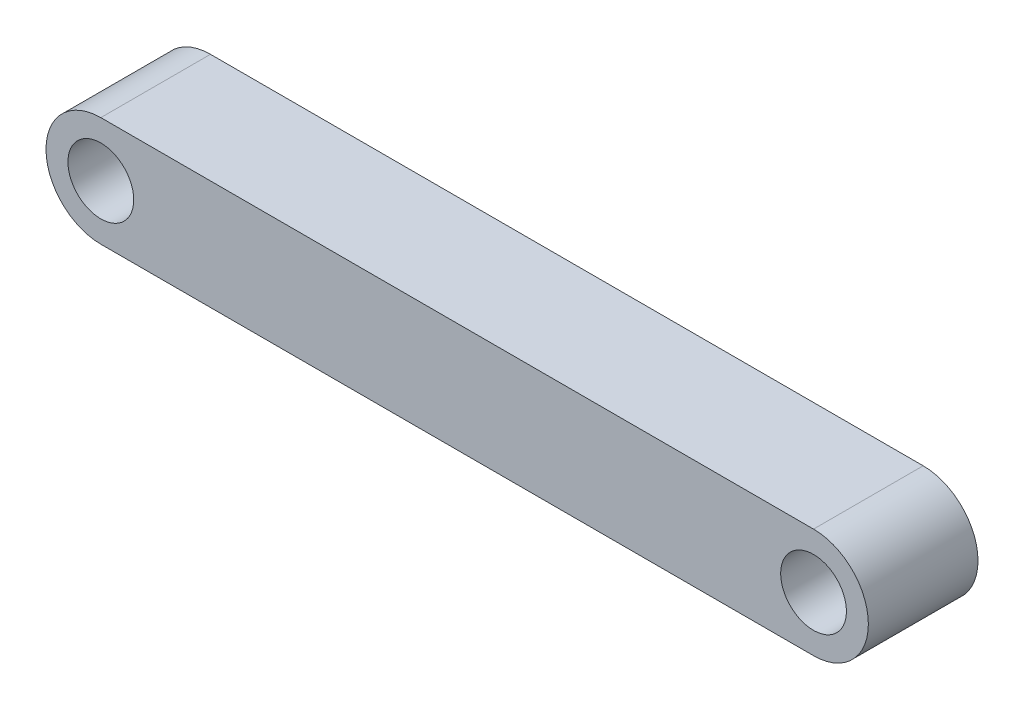
ISO-10303-21;
HEADER;
FILE_DESCRIPTION(('STEP AP214'),'2;1');
FILE_NAME('part.step','',(''),(''),'','','');
FILE_SCHEMA(('AUTOMOTIVE_DESIGN { 1 0 10303 214 1 1 1 1 }'));
ENDSEC;
DATA;
#1=APPLICATION_CONTEXT('core data for automotive mechanical design processes');
#2=APPLICATION_PROTOCOL_DEFINITION('international standard','automotive_design',2000,#1);
#3=PRODUCT_CONTEXT('',#1,'mechanical');
#4=PRODUCT('Part','Part','',(#3));
#5=PRODUCT_RELATED_PRODUCT_CATEGORY('part','',(#4));
#6=PRODUCT_DEFINITION_FORMATION('','',#4);
#7=PRODUCT_DEFINITION_CONTEXT('part definition',#1,'design');
#8=PRODUCT_DEFINITION('design','',#6,#7);
#9=PRODUCT_DEFINITION_SHAPE('','',#8);
#10=(LENGTH_UNIT() NAMED_UNIT(*) SI_UNIT(.MILLI.,.METRE.));
#11=(NAMED_UNIT(*) PLANE_ANGLE_UNIT() SI_UNIT($,.RADIAN.));
#12=(NAMED_UNIT(*) SI_UNIT($,.STERADIAN.) SOLID_ANGLE_UNIT());
#13=UNCERTAINTY_MEASURE_WITH_UNIT(LENGTH_MEASURE(1.E-05),#10,'distance_accuracy_value','');
#14=(GEOMETRIC_REPRESENTATION_CONTEXT(3) GLOBAL_UNCERTAINTY_ASSIGNED_CONTEXT((#13)) GLOBAL_UNIT_ASSIGNED_CONTEXT((#10,
#11,#12)) REPRESENTATION_CONTEXT('',''));
#15=CARTESIAN_POINT('',(0.,0.,0.));
#16=DIRECTION('',(0.,0.,1.));
#17=DIRECTION('',(1.,0.,0.));
#18=AXIS2_PLACEMENT_3D('',#15,#16,#17);
#19=CARTESIAN_POINT('',(-26.3333333333333,0.,5.));
#20=DIRECTION('',(0.,0.,1.));
#21=DIRECTION('',(1.,0.,0.));
#22=AXIS2_PLACEMENT_3D('',#19,#20,#21);
#23=PLANE('',#22);
#24=CARTESIAN_POINT('',(-26.3333333333333,0.,5.));
#25=DIRECTION('',(0.,0.,1.));
#26=DIRECTION('',(1.,0.,0.));
#27=AXIS2_PLACEMENT_3D('',#24,#25,#26);
#28=CIRCLE('',#27,1.5);
#29=CARTESIAN_POINT('',(-24.8333333333333,0.,5.));
#30=VERTEX_POINT('',#29);
#31=EDGE_CURVE('E101',#30,#30,#28,.T.);
#32=ORIENTED_EDGE('',*,*,#31,.F.);
#33=EDGE_LOOP('',(#32));
#34=FACE_BOUND('',#33,.T.);
#35=CARTESIAN_POINT('',(-26.3333333333333,0.,5.));
#36=DIRECTION('',(0.,0.,1.));
#37=DIRECTION('',(1.,0.,0.));
#38=AXIS2_PLACEMENT_3D('',#35,#36,#37);
#39=CIRCLE('',#38,2.5);
#40=CARTESIAN_POINT('',(-26.3333333333333,2.5,5.));
#41=VERTEX_POINT('',#40);
#42=CARTESIAN_POINT('',(-26.3333333333333,-2.5,5.));
#43=VERTEX_POINT('',#42);
#44=EDGE_CURVE('E86',#41,#43,#39,.T.);
#45=ORIENTED_EDGE('',*,*,#44,.T.);
#46=DIRECTION('',(1.,0.,0.));
#47=VECTOR('',#46,1.);
#48=CARTESIAN_POINT('',(-26.3333333333333,-2.5,5.));
#49=LINE('',#48,#47);
#50=CARTESIAN_POINT('',(6.16666666666666,-2.5,5.));
#51=VERTEX_POINT('',#50);
#52=EDGE_CURVE('E81',#43,#51,#49,.T.);
#53=ORIENTED_EDGE('',*,*,#52,.T.);
#54=CARTESIAN_POINT('',(6.16666666666666,0.,5.));
#55=DIRECTION('',(0.,0.,1.));
#56=DIRECTION('',(1.,0.,0.));
#57=AXIS2_PLACEMENT_3D('',#54,#55,#56);
#58=CIRCLE('',#57,2.5);
#59=CARTESIAN_POINT('',(6.16666666666666,2.5,5.));
#60=VERTEX_POINT('',#59);
#61=EDGE_CURVE('E84',#51,#60,#58,.T.);
#62=ORIENTED_EDGE('',*,*,#61,.T.);
#63=DIRECTION('',(-1.,0.,0.));
#64=VECTOR('',#63,1.);
#65=CARTESIAN_POINT('',(-26.3333333333333,2.5,5.));
#66=LINE('',#65,#64);
#67=EDGE_CURVE('E51',#60,#41,#66,.T.);
#68=ORIENTED_EDGE('',*,*,#67,.T.);
#69=EDGE_LOOP('',(#45,#53,#62,#68));
#70=FACE_BOUND('',#69,.T.);
#71=CARTESIAN_POINT('',(6.16666666666666,0.,5.));
#72=DIRECTION('',(0.,0.,1.));
#73=DIRECTION('',(-1.,0.,0.));
#74=AXIS2_PLACEMENT_3D('',#71,#72,#73);
#75=CIRCLE('',#74,1.5);
#76=CARTESIAN_POINT('',(4.66666666666666,0.,5.));
#77=VERTEX_POINT('',#76);
#78=EDGE_CURVE('E116',#77,#77,#75,.T.);
#79=ORIENTED_EDGE('',*,*,#78,.F.);
#80=EDGE_LOOP('',(#79));
#81=FACE_BOUND('',#80,.T.);
#82=ADVANCED_FACE('F34',(#34,#70,#81),#23,.T.);
#83=CARTESIAN_POINT('',(-26.3333333333333,0.,0.));
#84=DIRECTION('',(0.,0.,1.));
#85=DIRECTION('',(1.,0.,0.));
#86=AXIS2_PLACEMENT_3D('',#83,#84,#85);
#87=PLANE('',#86);
#88=CARTESIAN_POINT('',(-26.3333333333333,0.,0.));
#89=DIRECTION('',(0.,0.,1.));
#90=DIRECTION('',(1.,0.,0.));
#91=AXIS2_PLACEMENT_3D('',#88,#89,#90);
#92=CIRCLE('',#91,2.5);
#93=CARTESIAN_POINT('',(-26.3333333333333,2.5,0.));
#94=VERTEX_POINT('',#93);
#95=CARTESIAN_POINT('',(-26.3333333333333,-2.5,0.));
#96=VERTEX_POINT('',#95);
#97=EDGE_CURVE('E98',#94,#96,#92,.T.);
#98=ORIENTED_EDGE('',*,*,#97,.F.);
#99=DIRECTION('',(-1.,0.,0.));
#100=VECTOR('',#99,1.);
#101=CARTESIAN_POINT('',(-26.3333333333333,2.5,0.));
#102=LINE('',#101,#100);
#103=CARTESIAN_POINT('',(6.16666666666666,2.5,0.));
#104=VERTEX_POINT('',#103);
#105=EDGE_CURVE('E74',#104,#94,#102,.T.);
#106=ORIENTED_EDGE('',*,*,#105,.F.);
#107=CARTESIAN_POINT('',(6.16666666666666,0.,0.));
#108=DIRECTION('',(0.,0.,1.));
#109=DIRECTION('',(1.,0.,0.));
#110=AXIS2_PLACEMENT_3D('',#107,#108,#109);
#111=CIRCLE('',#110,2.5);
#112=CARTESIAN_POINT('',(6.16666666666666,-2.5,0.));
#113=VERTEX_POINT('',#112);
#114=EDGE_CURVE('E68',#113,#104,#111,.T.);
#115=ORIENTED_EDGE('',*,*,#114,.F.);
#116=DIRECTION('',(1.,0.,0.));
#117=VECTOR('',#116,1.);
#118=CARTESIAN_POINT('',(-26.3333333333333,-2.5,0.));
#119=LINE('',#118,#117);
#120=EDGE_CURVE('E90',#96,#113,#119,.T.);
#121=ORIENTED_EDGE('',*,*,#120,.F.);
#122=EDGE_LOOP('',(#98,#106,#115,#121));
#123=FACE_BOUND('',#122,.T.);
#124=CARTESIAN_POINT('',(-26.3333333333333,0.,0.));
#125=DIRECTION('',(0.,0.,1.));
#126=DIRECTION('',(1.,0.,0.));
#127=AXIS2_PLACEMENT_3D('',#124,#125,#126);
#128=CIRCLE('',#127,1.5);
#129=CARTESIAN_POINT('',(-24.8333333333333,0.,0.));
#130=VERTEX_POINT('',#129);
#131=EDGE_CURVE('E113',#130,#130,#128,.T.);
#132=ORIENTED_EDGE('',*,*,#131,.T.);
#133=EDGE_LOOP('',(#132));
#134=FACE_BOUND('',#133,.T.);
#135=CARTESIAN_POINT('',(6.16666666666666,0.,0.));
#136=DIRECTION('',(0.,0.,1.));
#137=DIRECTION('',(-1.,0.,0.));
#138=AXIS2_PLACEMENT_3D('',#135,#136,#137);
#139=CIRCLE('',#138,1.5);
#140=CARTESIAN_POINT('',(4.66666666666666,0.,0.));
#141=VERTEX_POINT('',#140);
#142=EDGE_CURVE('E119',#141,#141,#139,.T.);
#143=ORIENTED_EDGE('',*,*,#142,.T.);
#144=EDGE_LOOP('',(#143));
#145=FACE_BOUND('',#144,.T.);
#146=ADVANCED_FACE('F109',(#123,#134,#145),#87,.F.);
#147=CARTESIAN_POINT('',(-26.3333333333333,0.,5.));
#148=DIRECTION('',(0.,0.,-1.));
#149=DIRECTION('',(-1.,0.,0.));
#150=AXIS2_PLACEMENT_3D('',#147,#148,#149);
#151=CYLINDRICAL_SURFACE('',#150,2.5);
#152=ORIENTED_EDGE('',*,*,#97,.T.);
#153=DIRECTION('',(0.,0.,-1.));
#154=VECTOR('',#153,1.);
#155=CARTESIAN_POINT('',(-26.3333333333333,-2.5,5.));
#156=LINE('',#155,#154);
#157=EDGE_CURVE('E11',#43,#96,#156,.T.);
#158=ORIENTED_EDGE('',*,*,#157,.F.);
#159=ORIENTED_EDGE('',*,*,#44,.F.);
#160=DIRECTION('',(0.,0.,-1.));
#161=VECTOR('',#160,1.);
#162=CARTESIAN_POINT('',(-26.3333333333333,2.5,5.));
#163=LINE('',#162,#161);
#164=EDGE_CURVE('E94',#41,#94,#163,.T.);
#165=ORIENTED_EDGE('',*,*,#164,.T.);
#166=EDGE_LOOP('',(#152,#158,#159,#165));
#167=FACE_BOUND('',#166,.T.);
#168=ADVANCED_FACE('F36',(#167),#151,.T.);
#169=CARTESIAN_POINT('',(-26.3333333333333,-2.5,5.));
#170=DIRECTION('',(0.,1.,0.));
#171=DIRECTION('',(0.,0.,1.));
#172=AXIS2_PLACEMENT_3D('',#169,#170,#171);
#173=PLANE('',#172);
#174=ORIENTED_EDGE('',*,*,#120,.T.);
#175=DIRECTION('',(0.,0.,-1.));
#176=VECTOR('',#175,1.);
#177=CARTESIAN_POINT('',(6.16666666666666,-2.5,5.));
#178=LINE('',#177,#176);
#179=EDGE_CURVE('E43',#51,#113,#178,.T.);
#180=ORIENTED_EDGE('',*,*,#179,.F.);
#181=ORIENTED_EDGE('',*,*,#52,.F.);
#182=ORIENTED_EDGE('',*,*,#157,.T.);
#183=EDGE_LOOP('',(#174,#180,#181,#182));
#184=FACE_BOUND('',#183,.T.);
#185=ADVANCED_FACE('F89',(#184),#173,.F.);
#186=CARTESIAN_POINT('',(6.16666666666666,0.,5.));
#187=DIRECTION('',(0.,0.,-1.));
#188=DIRECTION('',(-1.,0.,0.));
#189=AXIS2_PLACEMENT_3D('',#186,#187,#188);
#190=CYLINDRICAL_SURFACE('',#189,2.5);
#191=ORIENTED_EDGE('',*,*,#114,.T.);
#192=DIRECTION('',(0.,0.,-1.));
#193=VECTOR('',#192,1.);
#194=CARTESIAN_POINT('',(6.16666666666666,2.5,5.));
#195=LINE('',#194,#193);
#196=EDGE_CURVE('E91',#60,#104,#195,.T.);
#197=ORIENTED_EDGE('',*,*,#196,.F.);
#198=ORIENTED_EDGE('',*,*,#61,.F.);
#199=ORIENTED_EDGE('',*,*,#179,.T.);
#200=EDGE_LOOP('',(#191,#197,#198,#199));
#201=FACE_BOUND('',#200,.T.);
#202=ADVANCED_FACE('F92',(#201),#190,.T.);
#203=CARTESIAN_POINT('',(-26.3333333333333,2.5,5.));
#204=DIRECTION('',(0.,-1.,0.));
#205=DIRECTION('',(0.,0.,-1.));
#206=AXIS2_PLACEMENT_3D('',#203,#204,#205);
#207=PLANE('',#206);
#208=ORIENTED_EDGE('',*,*,#105,.T.);
#209=ORIENTED_EDGE('',*,*,#164,.F.);
#210=ORIENTED_EDGE('',*,*,#67,.F.);
#211=ORIENTED_EDGE('',*,*,#196,.T.);
#212=EDGE_LOOP('',(#208,#209,#210,#211));
#213=FACE_BOUND('',#212,.T.);
#214=ADVANCED_FACE('F106',(#213),#207,.F.);
#215=CARTESIAN_POINT('',(-26.3333333333333,0.,5.));
#216=DIRECTION('',(0.,0.,-1.));
#217=DIRECTION('',(-1.,0.,0.));
#218=AXIS2_PLACEMENT_3D('',#215,#216,#217);
#219=CYLINDRICAL_SURFACE('',#218,1.5);
#220=ORIENTED_EDGE('',*,*,#31,.T.);
#221=EDGE_LOOP('',(#220));
#222=FACE_BOUND('',#221,.T.);
#223=ORIENTED_EDGE('',*,*,#131,.F.);
#224=EDGE_LOOP('',(#223));
#225=FACE_BOUND('',#224,.T.);
#226=ADVANCED_FACE('F136',(#222,#225),#219,.F.);
#227=CARTESIAN_POINT('',(6.16666666666666,0.,5.));
#228=DIRECTION('',(0.,0.,-1.));
#229=DIRECTION('',(-1.,0.,0.));
#230=AXIS2_PLACEMENT_3D('',#227,#228,#229);
#231=CYLINDRICAL_SURFACE('',#230,1.5);
#232=ORIENTED_EDGE('',*,*,#78,.T.);
#233=EDGE_LOOP('',(#232));
#234=FACE_BOUND('',#233,.T.);
#235=ORIENTED_EDGE('',*,*,#142,.F.);
#236=EDGE_LOOP('',(#235));
#237=FACE_BOUND('',#236,.T.);
#238=ADVANCED_FACE('F125',(#234,#237),#231,.F.);
#239=CLOSED_SHELL('',(#82,#146,#168,#185,#202,#214,#226,#238));
#240=MANIFOLD_SOLID_BREP('B2',#239);
#241=ADVANCED_BREP_SHAPE_REPRESENTATION('',(#18,#240),#14);
#242=SHAPE_DEFINITION_REPRESENTATION(#9,#241);
ENDSEC;
END-ISO-10303-21;
